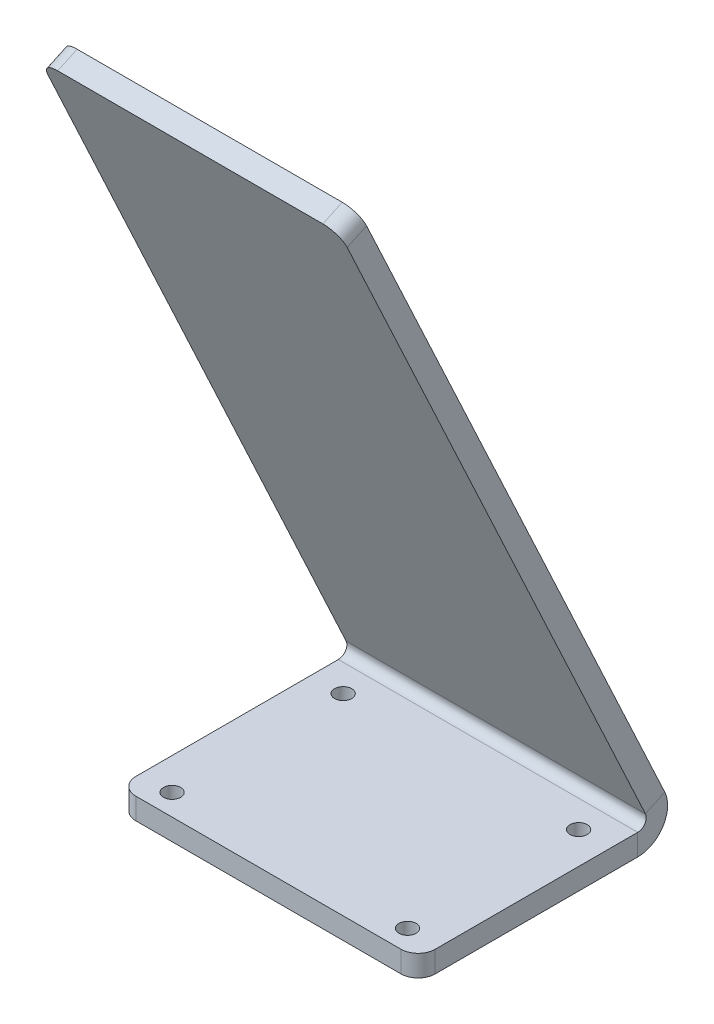
ISO-10303-21;
HEADER;
FILE_DESCRIPTION(('STEP AP214'),'2;1');
FILE_NAME('part.step','',(''),(''),'','','');
FILE_SCHEMA(('AUTOMOTIVE_DESIGN { 1 0 10303 214 1 1 1 1 }'));
ENDSEC;
DATA;
#1=APPLICATION_CONTEXT('core data for automotive mechanical design processes');
#2=APPLICATION_PROTOCOL_DEFINITION('international standard','automotive_design',2000,#1);
#3=PRODUCT_CONTEXT('',#1,'mechanical');
#4=PRODUCT('Part','Part','',(#3));
#5=PRODUCT_RELATED_PRODUCT_CATEGORY('part','',(#4));
#6=PRODUCT_DEFINITION_FORMATION('','',#4);
#7=PRODUCT_DEFINITION_CONTEXT('part definition',#1,'design');
#8=PRODUCT_DEFINITION('design','',#6,#7);
#9=PRODUCT_DEFINITION_SHAPE('','',#8);
#10=(LENGTH_UNIT() NAMED_UNIT(*) SI_UNIT(.MILLI.,.METRE.));
#11=(NAMED_UNIT(*) PLANE_ANGLE_UNIT() SI_UNIT($,.RADIAN.));
#12=(NAMED_UNIT(*) SI_UNIT($,.STERADIAN.) SOLID_ANGLE_UNIT());
#13=UNCERTAINTY_MEASURE_WITH_UNIT(LENGTH_MEASURE(1.E-05),#10,'distance_accuracy_value','');
#14=(GEOMETRIC_REPRESENTATION_CONTEXT(3) GLOBAL_UNCERTAINTY_ASSIGNED_CONTEXT((#13)) GLOBAL_UNIT_ASSIGNED_CONTEXT((#10,
#11,#12)) REPRESENTATION_CONTEXT('',''));
#15=CARTESIAN_POINT('',(0.,0.,0.));
#16=DIRECTION('',(0.,0.,1.));
#17=DIRECTION('',(1.,0.,0.));
#18=AXIS2_PLACEMENT_3D('',#15,#16,#17);
#19=CARTESIAN_POINT('',(0.,0.,0.));
#20=DIRECTION('',(0.,-1.,0.));
#21=DIRECTION('',(0.,0.,-1.));
#22=AXIS2_PLACEMENT_3D('',#19,#20,#21);
#23=PLANE('',#22);
#24=CARTESIAN_POINT('',(-34.9631,0.,-19.05));
#25=DIRECTION('',(0.,1.,0.));
#26=DIRECTION('',(0.,0.,1.));
#27=AXIS2_PLACEMENT_3D('',#24,#25,#26);
#28=CIRCLE('',#27,2.5527);
#29=CARTESIAN_POINT('',(-34.9631,0.,-16.4973));
#30=VERTEX_POINT('',#29);
#31=EDGE_CURVE('E549',#30,#30,#28,.T.);
#32=ORIENTED_EDGE('',*,*,#31,.F.);
#33=EDGE_LOOP('',(#32));
#34=FACE_BOUND('',#33,.T.);
#35=CARTESIAN_POINT('',(34.9631,0.,-19.05));
#36=DIRECTION('',(0.,1.,0.));
#37=DIRECTION('',(0.,0.,1.));
#38=AXIS2_PLACEMENT_3D('',#35,#36,#37);
#39=CIRCLE('',#38,2.5527);
#40=CARTESIAN_POINT('',(34.9631,0.,-16.4973));
#41=VERTEX_POINT('',#40);
#42=EDGE_CURVE('E543',#41,#41,#39,.T.);
#43=ORIENTED_EDGE('',*,*,#42,.F.);
#44=EDGE_LOOP('',(#43));
#45=FACE_BOUND('',#44,.T.);
#46=CARTESIAN_POINT('',(-34.9631,0.,31.75));
#47=DIRECTION('',(0.,1.,0.));
#48=DIRECTION('',(0.,0.,1.));
#49=AXIS2_PLACEMENT_3D('',#46,#47,#48);
#50=CIRCLE('',#49,2.5527);
#51=CARTESIAN_POINT('',(-34.9631,0.,34.3027));
#52=VERTEX_POINT('',#51);
#53=EDGE_CURVE('E530',#52,#52,#50,.T.);
#54=ORIENTED_EDGE('',*,*,#53,.F.);
#55=EDGE_LOOP('',(#54));
#56=FACE_BOUND('',#55,.T.);
#57=DIRECTION('',(1.,0.,0.));
#58=VECTOR('',#57,1.);
#59=CARTESIAN_POINT('',(-44.45,0.,38.1));
#60=LINE('',#59,#58);
#61=CARTESIAN_POINT('',(-39.37,0.,38.1));
#62=VERTEX_POINT('',#61);
#63=CARTESIAN_POINT('',(39.37,0.,38.1));
#64=VERTEX_POINT('',#63);
#65=EDGE_CURVE('E225',#62,#64,#60,.T.);
#66=ORIENTED_EDGE('',*,*,#65,.T.);
#67=CARTESIAN_POINT('',(39.37,0.,33.02));
#68=DIRECTION('',(0.,-1.,0.));
#69=DIRECTION('',(0.,0.,-1.));
#70=AXIS2_PLACEMENT_3D('',#67,#68,#69);
#71=CIRCLE('',#70,5.08);
#72=CARTESIAN_POINT('',(44.45,0.,33.02));
#73=VERTEX_POINT('',#72);
#74=EDGE_CURVE('E244',#64,#73,#71,.F.);
#75=ORIENTED_EDGE('',*,*,#74,.T.);
#76=DIRECTION('',(0.,0.,-1.));
#77=VECTOR('',#76,1.);
#78=CARTESIAN_POINT('',(44.45,0.,38.1));
#79=LINE('',#78,#77);
#80=CARTESIAN_POINT('',(44.45,0.,-27.1065488487098));
#81=VERTEX_POINT('',#80);
#82=EDGE_CURVE('E220',#73,#81,#79,.T.);
#83=ORIENTED_EDGE('',*,*,#82,.T.);
#84=DIRECTION('',(-1.,0.,0.));
#85=VECTOR('',#84,1.);
#86=CARTESIAN_POINT('',(-44.45,0.,-27.1065488487098));
#87=LINE('',#86,#85);
#88=CARTESIAN_POINT('',(-44.45,0.,-27.1065488487098));
#89=VERTEX_POINT('',#88);
#90=EDGE_CURVE('E213',#89,#81,#87,.F.);
#91=ORIENTED_EDGE('',*,*,#90,.F.);
#92=DIRECTION('',(0.,0.,1.));
#93=VECTOR('',#92,1.);
#94=CARTESIAN_POINT('',(-44.45,0.,38.1));
#95=LINE('',#94,#93);
#96=CARTESIAN_POINT('',(-44.45,0.,33.02));
#97=VERTEX_POINT('',#96);
#98=EDGE_CURVE('E233',#89,#97,#95,.T.);
#99=ORIENTED_EDGE('',*,*,#98,.T.);
#100=CARTESIAN_POINT('',(-39.37,0.,33.02));
#101=DIRECTION('',(0.,-1.,0.));
#102=DIRECTION('',(0.,0.,-1.));
#103=AXIS2_PLACEMENT_3D('',#100,#101,#102);
#104=CIRCLE('',#103,5.08);
#105=EDGE_CURVE('E242',#97,#62,#104,.F.);
#106=ORIENTED_EDGE('',*,*,#105,.T.);
#107=EDGE_LOOP('',(#66,#75,#83,#91,#99,#106));
#108=FACE_BOUND('',#107,.T.);
#109=CARTESIAN_POINT('',(34.9631,0.,31.75));
#110=DIRECTION('',(0.,1.,0.));
#111=DIRECTION('',(0.,0.,1.));
#112=AXIS2_PLACEMENT_3D('',#109,#110,#111);
#113=CIRCLE('',#112,2.5527);
#114=CARTESIAN_POINT('',(34.9631,0.,34.3027));
#115=VERTEX_POINT('',#114);
#116=EDGE_CURVE('E535',#115,#115,#113,.T.);
#117=ORIENTED_EDGE('',*,*,#116,.F.);
#118=EDGE_LOOP('',(#117));
#119=FACE_BOUND('',#118,.T.);
#120=ADVANCED_FACE('F69',(#34,#45,#56,#108,#119),#23,.F.);
#121=CARTESIAN_POINT('',(-44.45,-6.35,38.1));
#122=DIRECTION('',(-1.,0.,0.));
#123=DIRECTION('',(0.,0.,1.));
#124=AXIS2_PLACEMENT_3D('',#121,#122,#123);
#125=PLANE('',#124);
#126=DIRECTION('',(0.,0.,1.));
#127=VECTOR('',#126,1.);
#128=CARTESIAN_POINT('',(-44.45,-6.35,38.1));
#129=LINE('',#128,#127);
#130=CARTESIAN_POINT('',(-44.45,-6.34999999999998,-27.1065488487098));
#131=VERTEX_POINT('',#130);
#132=CARTESIAN_POINT('',(-44.45,-6.35,33.02));
#133=VERTEX_POINT('',#132);
#134=EDGE_CURVE('E224',#131,#133,#129,.T.);
#135=ORIENTED_EDGE('',*,*,#134,.T.);
#136=DIRECTION('',(0.,1.,0.));
#137=VECTOR('',#136,1.);
#138=CARTESIAN_POINT('',(-44.45,-6.35,33.02));
#139=LINE('',#138,#137);
#140=EDGE_CURVE('E252',#133,#97,#139,.T.);
#141=ORIENTED_EDGE('',*,*,#140,.T.);
#142=ORIENTED_EDGE('',*,*,#98,.F.);
#143=DIRECTION('',(0.,-1.,0.));
#144=VECTOR('',#143,1.);
#145=CARTESIAN_POINT('',(-44.45,0.,-27.1065488487098));
#146=LINE('',#145,#144);
#147=EDGE_CURVE('E209',#89,#131,#146,.T.);
#148=ORIENTED_EDGE('',*,*,#147,.T.);
#149=EDGE_LOOP('',(#135,#141,#142,#148));
#150=FACE_BOUND('',#149,.T.);
#151=ADVANCED_FACE('F314',(#150),#125,.T.);
#152=CARTESIAN_POINT('',(0.,-6.35,0.));
#153=DIRECTION('',(0.,-1.,0.));
#154=DIRECTION('',(0.,0.,-1.));
#155=AXIS2_PLACEMENT_3D('',#152,#153,#154);
#156=PLANE('',#155);
#157=CARTESIAN_POINT('',(-34.9631,-6.35,-19.05));
#158=DIRECTION('',(0.,1.,0.));
#159=DIRECTION('',(0.,0.,1.));
#160=AXIS2_PLACEMENT_3D('',#157,#158,#159);
#161=CIRCLE('',#160,2.5527);
#162=CARTESIAN_POINT('',(-34.9631,-6.35,-16.4973));
#163=VERTEX_POINT('',#162);
#164=EDGE_CURVE('E546',#163,#163,#161,.T.);
#165=ORIENTED_EDGE('',*,*,#164,.T.);
#166=EDGE_LOOP('',(#165));
#167=FACE_BOUND('',#166,.T.);
#168=CARTESIAN_POINT('',(34.9631,-6.35,-19.05));
#169=DIRECTION('',(0.,1.,0.));
#170=DIRECTION('',(0.,0.,1.));
#171=AXIS2_PLACEMENT_3D('',#168,#169,#170);
#172=CIRCLE('',#171,2.5527);
#173=CARTESIAN_POINT('',(34.9631,-6.35,-16.4973));
#174=VERTEX_POINT('',#173);
#175=EDGE_CURVE('E540',#174,#174,#172,.T.);
#176=ORIENTED_EDGE('',*,*,#175,.T.);
#177=EDGE_LOOP('',(#176));
#178=FACE_BOUND('',#177,.T.);
#179=CARTESIAN_POINT('',(34.9631,-6.35,31.75));
#180=DIRECTION('',(0.,1.,0.));
#181=DIRECTION('',(0.,0.,1.));
#182=AXIS2_PLACEMENT_3D('',#179,#180,#181);
#183=CIRCLE('',#182,2.5527);
#184=CARTESIAN_POINT('',(34.9631,-6.35,34.3027));
#185=VERTEX_POINT('',#184);
#186=EDGE_CURVE('E532',#185,#185,#183,.T.);
#187=ORIENTED_EDGE('',*,*,#186,.T.);
#188=EDGE_LOOP('',(#187));
#189=FACE_BOUND('',#188,.T.);
#190=CARTESIAN_POINT('',(-34.9631,-6.35,31.75));
#191=DIRECTION('',(0.,1.,0.));
#192=DIRECTION('',(0.,0.,1.));
#193=AXIS2_PLACEMENT_3D('',#190,#191,#192);
#194=CIRCLE('',#193,2.5527);
#195=CARTESIAN_POINT('',(-34.9631,-6.35,34.3027));
#196=VERTEX_POINT('',#195);
#197=EDGE_CURVE('E206',#196,#196,#194,.T.);
#198=ORIENTED_EDGE('',*,*,#197,.T.);
#199=EDGE_LOOP('',(#198));
#200=FACE_BOUND('',#199,.T.);
#201=DIRECTION('',(0.,0.,-1.));
#202=VECTOR('',#201,1.);
#203=CARTESIAN_POINT('',(44.45,-6.35,38.1));
#204=LINE('',#203,#202);
#205=CARTESIAN_POINT('',(44.45,-6.35,33.02));
#206=VERTEX_POINT('',#205);
#207=CARTESIAN_POINT('',(44.45,-6.35,-27.1065488487098));
#208=VERTEX_POINT('',#207);
#209=EDGE_CURVE('E222',#206,#208,#204,.T.);
#210=ORIENTED_EDGE('',*,*,#209,.F.);
#211=CARTESIAN_POINT('',(39.37,-6.35,33.02));
#212=DIRECTION('',(0.,-1.,0.));
#213=DIRECTION('',(0.,0.,-1.));
#214=AXIS2_PLACEMENT_3D('',#211,#212,#213);
#215=CIRCLE('',#214,5.08);
#216=CARTESIAN_POINT('',(39.37,-6.35,38.1));
#217=VERTEX_POINT('',#216);
#218=EDGE_CURVE('E250',#206,#217,#215,.T.);
#219=ORIENTED_EDGE('',*,*,#218,.T.);
#220=DIRECTION('',(1.,0.,0.));
#221=VECTOR('',#220,1.);
#222=CARTESIAN_POINT('',(-44.45,-6.35,38.1));
#223=LINE('',#222,#221);
#224=CARTESIAN_POINT('',(-39.37,-6.35,38.1));
#225=VERTEX_POINT('',#224);
#226=EDGE_CURVE('E228',#225,#217,#223,.T.);
#227=ORIENTED_EDGE('',*,*,#226,.F.);
#228=CARTESIAN_POINT('',(-39.37,-6.35,33.02));
#229=DIRECTION('',(0.,-1.,0.));
#230=DIRECTION('',(0.,0.,-1.));
#231=AXIS2_PLACEMENT_3D('',#228,#229,#230);
#232=CIRCLE('',#231,5.08);
#233=EDGE_CURVE('E248',#225,#133,#232,.T.);
#234=ORIENTED_EDGE('',*,*,#233,.T.);
#235=ORIENTED_EDGE('',*,*,#134,.F.);
#236=DIRECTION('',(-1.,0.,0.));
#237=VECTOR('',#236,1.);
#238=CARTESIAN_POINT('',(-44.45,-6.34999999999998,-27.1065488487098));
#239=LINE('',#238,#237);
#240=EDGE_CURVE('E169',#131,#208,#239,.F.);
#241=ORIENTED_EDGE('',*,*,#240,.T.);
#242=EDGE_LOOP('',(#210,#219,#227,#234,#235,#241));
#243=FACE_BOUND('',#242,.T.);
#244=ADVANCED_FACE('F296',(#167,#178,#189,#200,#243),#156,.T.);
#245=CARTESIAN_POINT('',(44.45,-6.35,38.1));
#246=DIRECTION('',(1.,0.,0.));
#247=DIRECTION('',(0.,0.,-1.));
#248=AXIS2_PLACEMENT_3D('',#245,#246,#247);
#249=PLANE('',#248);
#250=ORIENTED_EDGE('',*,*,#82,.F.);
#251=DIRECTION('',(0.,1.,0.));
#252=VECTOR('',#251,1.);
#253=CARTESIAN_POINT('',(44.45,-6.35,33.02));
#254=LINE('',#253,#252);
#255=EDGE_CURVE('E246',#73,#206,#254,.F.);
#256=ORIENTED_EDGE('',*,*,#255,.T.);
#257=ORIENTED_EDGE('',*,*,#209,.T.);
#258=DIRECTION('',(0.,-1.,0.));
#259=VECTOR('',#258,1.);
#260=CARTESIAN_POINT('',(44.45,0.,-27.1065488487098));
#261=LINE('',#260,#259);
#262=EDGE_CURVE('E217',#81,#208,#261,.T.);
#263=ORIENTED_EDGE('',*,*,#262,.F.);
#264=EDGE_LOOP('',(#250,#256,#257,#263));
#265=FACE_BOUND('',#264,.T.);
#266=ADVANCED_FACE('F291',(#265),#249,.T.);
#267=CARTESIAN_POINT('',(-44.45,-6.35,38.1));
#268=DIRECTION('',(0.,0.,1.));
#269=DIRECTION('',(1.,0.,0.));
#270=AXIS2_PLACEMENT_3D('',#267,#268,#269);
#271=PLANE('',#270);
#272=ORIENTED_EDGE('',*,*,#226,.T.);
#273=DIRECTION('',(0.,1.,0.));
#274=VECTOR('',#273,1.);
#275=CARTESIAN_POINT('',(39.37,-6.35,38.1));
#276=LINE('',#275,#274);
#277=EDGE_CURVE('E239',#217,#64,#276,.T.);
#278=ORIENTED_EDGE('',*,*,#277,.T.);
#279=ORIENTED_EDGE('',*,*,#65,.F.);
#280=DIRECTION('',(0.,1.,0.));
#281=VECTOR('',#280,1.);
#282=CARTESIAN_POINT('',(-39.37,-6.35,38.1));
#283=LINE('',#282,#281);
#284=EDGE_CURVE('E231',#62,#225,#283,.F.);
#285=ORIENTED_EDGE('',*,*,#284,.T.);
#286=EDGE_LOOP('',(#272,#278,#279,#285));
#287=FACE_BOUND('',#286,.T.);
#288=ADVANCED_FACE('F304',(#287),#271,.T.);
#289=CARTESIAN_POINT('',(44.45,2.54000000000001,-27.1065488487098));
#290=DIRECTION('',(1.,0.,0.));
#291=DIRECTION('',(0.,1.,0.));
#292=AXIS2_PLACEMENT_3D('',#289,#290,#291);
#293=PLANE('',#292);
#294=DIRECTION('',(0.,-0.422618261740697,0.906307787036651));
#295=VECTOR('',#294,1.);
#296=CARTESIAN_POINT('',(44.45,6.2970763468748,-35.1636250754656));
#297=LINE('',#296,#295);
#298=CARTESIAN_POINT('',(44.45,3.61345038482138,-29.4085706277829));
#299=VERTEX_POINT('',#298);
#300=CARTESIAN_POINT('',(44.45,6.2970763468748,-35.1636250754656));
#301=VERTEX_POINT('',#300);
#302=EDGE_CURVE('E203',#299,#301,#297,.F.);
#303=ORIENTED_EDGE('',*,*,#302,.F.);
#304=CARTESIAN_POINT('',(44.45,2.54000000000001,-27.1065488487098));
#305=DIRECTION('',(-1.,0.,0.));
#306=DIRECTION('',(0.,-1.,0.));
#307=AXIS2_PLACEMENT_3D('',#304,#305,#306);
#308=CIRCLE('',#307,2.53999999999999);
#309=EDGE_CURVE('E172',#81,#299,#308,.F.);
#310=ORIENTED_EDGE('',*,*,#309,.F.);
#311=ORIENTED_EDGE('',*,*,#262,.T.);
#312=CARTESIAN_POINT('',(44.45,2.54000000000001,-27.1065488487098));
#313=DIRECTION('',(-1.,0.,0.));
#314=DIRECTION('',(0.,-1.,0.));
#315=AXIS2_PLACEMENT_3D('',#312,#313,#314);
#316=CIRCLE('',#315,8.88999999999999);
#317=EDGE_CURVE('E208',#208,#301,#316,.F.);
#318=ORIENTED_EDGE('',*,*,#317,.T.);
#319=EDGE_LOOP('',(#303,#310,#311,#318));
#320=FACE_BOUND('',#319,.T.);
#321=ADVANCED_FACE('F288',(#320),#293,.T.);
#322=CARTESIAN_POINT('',(-44.45,2.54000000000002,-27.1065488487098));
#323=DIRECTION('',(1.,0.,0.));
#324=DIRECTION('',(0.,1.,0.));
#325=AXIS2_PLACEMENT_3D('',#322,#323,#324);
#326=PLANE('',#325);
#327=CARTESIAN_POINT('',(-44.45,2.54000000000002,-27.1065488487098));
#328=DIRECTION('',(-1.,0.,0.));
#329=DIRECTION('',(0.,-1.,0.));
#330=AXIS2_PLACEMENT_3D('',#327,#328,#329);
#331=CIRCLE('',#330,2.53999999999999);
#332=CARTESIAN_POINT('',(-44.45,3.61345038482138,-29.4085706277829));
#333=VERTEX_POINT('',#332);
#334=EDGE_CURVE('E179',#333,#89,#331,.T.);
#335=ORIENTED_EDGE('',*,*,#334,.F.);
#336=DIRECTION('',(0.,-0.422618261740697,0.906307787036651));
#337=VECTOR('',#336,1.);
#338=CARTESIAN_POINT('',(-44.45,3.61345038482138,-29.4085706277829));
#339=LINE('',#338,#337);
#340=CARTESIAN_POINT('',(-44.45,6.29707634687481,-35.1636250754656));
#341=VERTEX_POINT('',#340);
#342=EDGE_CURVE('E176',#333,#341,#339,.F.);
#343=ORIENTED_EDGE('',*,*,#342,.T.);
#344=CARTESIAN_POINT('',(-44.45,2.54000000000002,-27.1065488487098));
#345=DIRECTION('',(-1.,0.,0.));
#346=DIRECTION('',(0.,-1.,0.));
#347=AXIS2_PLACEMENT_3D('',#344,#345,#346);
#348=CIRCLE('',#347,8.88999999999999);
#349=EDGE_CURVE('E161',#341,#131,#348,.T.);
#350=ORIENTED_EDGE('',*,*,#349,.T.);
#351=ORIENTED_EDGE('',*,*,#147,.F.);
#352=EDGE_LOOP('',(#335,#343,#350,#351));
#353=FACE_BOUND('',#352,.T.);
#354=ADVANCED_FACE('F177',(#353),#326,.F.);
#355=CARTESIAN_POINT('',(-44.45,2.54000000000002,-27.1065488487098));
#356=DIRECTION('',(-1.,0.,0.));
#357=DIRECTION('',(0.,0.422618261740697,-0.906307787036651));
#358=AXIS2_PLACEMENT_3D('',#355,#356,#357);
#359=CYLINDRICAL_SURFACE('',#358,8.88999999999999);
#360=ORIENTED_EDGE('',*,*,#240,.F.);
#361=ORIENTED_EDGE('',*,*,#349,.F.);
#362=DIRECTION('',(-1.,0.,0.));
#363=VECTOR('',#362,1.);
#364=CARTESIAN_POINT('',(44.45,6.2970763468748,-35.1636250754656));
#365=LINE('',#364,#363);
#366=EDGE_CURVE('E166',#341,#301,#365,.F.);
#367=ORIENTED_EDGE('',*,*,#366,.T.);
#368=ORIENTED_EDGE('',*,*,#317,.F.);
#369=EDGE_LOOP('',(#360,#361,#367,#368));
#370=FACE_BOUND('',#369,.T.);
#371=ADVANCED_FACE('F163',(#370),#359,.T.);
#372=CARTESIAN_POINT('',(-44.45,2.54000000000002,-27.1065488487098));
#373=DIRECTION('',(-1.,0.,0.));
#374=DIRECTION('',(0.,0.422618261740697,-0.906307787036651));
#375=AXIS2_PLACEMENT_3D('',#372,#373,#374);
#376=CYLINDRICAL_SURFACE('',#375,2.53999999999999);
#377=ORIENTED_EDGE('',*,*,#90,.T.);
#378=ORIENTED_EDGE('',*,*,#309,.T.);
#379=DIRECTION('',(-1.,0.,0.));
#380=VECTOR('',#379,1.);
#381=CARTESIAN_POINT('',(44.45,3.61345038482138,-29.4085706277829));
#382=LINE('',#381,#380);
#383=EDGE_CURVE('E181',#299,#333,#382,.T.);
#384=ORIENTED_EDGE('',*,*,#383,.T.);
#385=ORIENTED_EDGE('',*,*,#334,.T.);
#386=EDGE_LOOP('',(#377,#378,#384,#385));
#387=FACE_BOUND('',#386,.T.);
#388=ADVANCED_FACE('F283',(#387),#376,.F.);
#389=CARTESIAN_POINT('',(44.45,2.68362596205343,-36.8486046622709));
#390=DIRECTION('',(-1.,0.,0.));
#391=DIRECTION('',(0.,-1.,0.));
#392=AXIS2_PLACEMENT_3D('',#389,#390,#391);
#393=PLANE('',#392);
#394=DIRECTION('',(0.,-0.906307787036651,-0.422618261740697));
#395=VECTOR('',#394,1.);
#396=CARTESIAN_POINT('',(44.45,17.2767726034699,-30.0437086267996));
#397=LINE('',#396,#395);
#398=CARTESIAN_POINT('',(44.45,196.227916558432,53.4025802349963));
#399=VERTEX_POINT('',#398);
#400=EDGE_CURVE('E186',#399,#301,#397,.T.);
#401=ORIENTED_EDGE('',*,*,#400,.F.);
#402=DIRECTION('',(0.,-0.422618261740697,0.906307787036651));
#403=VECTOR('',#402,1.);
#404=CARTESIAN_POINT('',(44.45,196.227916558432,53.4025802349963));
#405=LINE('',#404,#403);
#406=CARTESIAN_POINT('',(44.45,193.544290596379,59.1576346826791));
#407=VERTEX_POINT('',#406);
#408=EDGE_CURVE('E15',#399,#407,#405,.T.);
#409=ORIENTED_EDGE('',*,*,#408,.T.);
#410=DIRECTION('',(0.,0.906307787036651,0.422618261740697));
#411=VECTOR('',#410,1.);
#412=CARTESIAN_POINT('',(44.45,0.,-31.0935502145882));
#413=LINE('',#412,#411);
#414=EDGE_CURVE('E187',#407,#299,#413,.F.);
#415=ORIENTED_EDGE('',*,*,#414,.T.);
#416=ORIENTED_EDGE('',*,*,#302,.T.);
#417=EDGE_LOOP('',(#401,#409,#415,#416));
#418=FACE_BOUND('',#417,.T.);
#419=ADVANCED_FACE('F280',(#418),#393,.F.);
#420=CARTESIAN_POINT('',(-44.45,200.831960116578,55.5494810046391));
#421=DIRECTION('',(1.,0.,0.));
#422=DIRECTION('',(0.,1.,0.));
#423=AXIS2_PLACEMENT_3D('',#420,#421,#422);
#424=PLANE('',#423);
#425=DIRECTION('',(0.,-0.906307787036651,-0.422618261740697));
#426=VECTOR('',#425,1.);
#427=CARTESIAN_POINT('',(-44.45,198.148334154525,61.3045354523218));
#428=LINE('',#427,#426);
#429=CARTESIAN_POINT('',(-44.45,193.544290596379,59.1576346826791));
#430=VERTEX_POINT('',#429);
#431=EDGE_CURVE('E199',#333,#430,#428,.F.);
#432=ORIENTED_EDGE('',*,*,#431,.T.);
#433=DIRECTION('',(0.,-0.422618261740697,0.906307787036651));
#434=VECTOR('',#433,1.);
#435=CARTESIAN_POINT('',(-44.45,196.227916558432,53.4025802349964));
#436=LINE('',#435,#434);
#437=CARTESIAN_POINT('',(-44.45,196.227916558432,53.4025802349964));
#438=VERTEX_POINT('',#437);
#439=EDGE_CURVE('E92',#430,#438,#436,.F.);
#440=ORIENTED_EDGE('',*,*,#439,.T.);
#441=DIRECTION('',(0.,0.906307787036651,0.422618261740697));
#442=VECTOR('',#441,1.);
#443=CARTESIAN_POINT('',(-44.45,17.2767726034699,-30.0437086267996));
#444=LINE('',#443,#442);
#445=EDGE_CURVE('E184',#341,#438,#444,.T.);
#446=ORIENTED_EDGE('',*,*,#445,.F.);
#447=ORIENTED_EDGE('',*,*,#342,.F.);
#448=EDGE_LOOP('',(#432,#440,#446,#447));
#449=FACE_BOUND('',#448,.T.);
#450=ADVANCED_FACE('F189',(#449),#424,.F.);
#451=CARTESIAN_POINT('',(0.,17.2767726034699,-30.0437086267996));
#452=DIRECTION('',(0.,-0.422618261740697,0.906307787036651));
#453=DIRECTION('',(0.,-0.906307787036651,-0.422618261740697));
#454=AXIS2_PLACEMENT_3D('',#451,#452,#453);
#455=PLANE('',#454);
#456=ORIENTED_EDGE('',*,*,#445,.T.);
#457=CARTESIAN_POINT('',(-39.37,196.227916558432,53.4025802349963));
#458=DIRECTION('',(0.,-0.422618261740697,0.906307787036651));
#459=DIRECTION('',(0.,-0.906307787036651,-0.422618261740697));
#460=AXIS2_PLACEMENT_3D('',#457,#458,#459);
#461=CIRCLE('',#460,5.08);
#462=CARTESIAN_POINT('',(-39.37,200.831960116578,55.5494810046391));
#463=VERTEX_POINT('',#462);
#464=EDGE_CURVE('E77',#438,#463,#461,.F.);
#465=ORIENTED_EDGE('',*,*,#464,.T.);
#466=DIRECTION('',(1.,0.,0.));
#467=VECTOR('',#466,1.);
#468=CARTESIAN_POINT('',(0.,200.831960116578,55.5494810046391));
#469=LINE('',#468,#467);
#470=CARTESIAN_POINT('',(39.37,200.831960116578,55.5494810046391));
#471=VERTEX_POINT('',#470);
#472=EDGE_CURVE('E190',#463,#471,#469,.T.);
#473=ORIENTED_EDGE('',*,*,#472,.T.);
#474=CARTESIAN_POINT('',(39.37,196.227916558432,53.4025802349963));
#475=DIRECTION('',(0.,-0.422618261740697,0.906307787036651));
#476=DIRECTION('',(0.,-0.906307787036651,-0.422618261740697));
#477=AXIS2_PLACEMENT_3D('',#474,#475,#476);
#478=CIRCLE('',#477,5.08);
#479=EDGE_CURVE('E84',#471,#399,#478,.F.);
#480=ORIENTED_EDGE('',*,*,#479,.T.);
#481=ORIENTED_EDGE('',*,*,#400,.T.);
#482=ORIENTED_EDGE('',*,*,#366,.F.);
#483=EDGE_LOOP('',(#456,#465,#473,#480,#481,#482));
#484=FACE_BOUND('',#483,.T.);
#485=ADVANCED_FACE('F183',(#484),#455,.F.);
#486=CARTESIAN_POINT('',(0.,14.5931466414165,-24.2886541791169));
#487=DIRECTION('',(0.,-0.422618261740697,0.906307787036651));
#488=DIRECTION('',(0.,-0.906307787036651,-0.422618261740697));
#489=AXIS2_PLACEMENT_3D('',#486,#487,#488);
#490=PLANE('',#489);
#491=DIRECTION('',(-1.,0.,0.));
#492=VECTOR('',#491,1.);
#493=CARTESIAN_POINT('',(44.45,198.148334154525,61.3045354523218));
#494=LINE('',#493,#492);
#495=CARTESIAN_POINT('',(-39.37,198.148334154525,61.3045354523218));
#496=VERTEX_POINT('',#495);
#497=CARTESIAN_POINT('',(39.37,198.148334154525,61.3045354523218));
#498=VERTEX_POINT('',#497);
#499=EDGE_CURVE('E193',#496,#498,#494,.F.);
#500=ORIENTED_EDGE('',*,*,#499,.F.);
#501=CARTESIAN_POINT('',(-39.37,193.544290596379,59.1576346826791));
#502=DIRECTION('',(0.,-0.422618261740697,0.906307787036651));
#503=DIRECTION('',(0.,-0.906307787036651,-0.422618261740697));
#504=AXIS2_PLACEMENT_3D('',#501,#502,#503);
#505=CIRCLE('',#504,5.08);
#506=EDGE_CURVE('E262',#496,#430,#505,.T.);
#507=ORIENTED_EDGE('',*,*,#506,.T.);
#508=ORIENTED_EDGE('',*,*,#431,.F.);
#509=ORIENTED_EDGE('',*,*,#383,.F.);
#510=ORIENTED_EDGE('',*,*,#414,.F.);
#511=CARTESIAN_POINT('',(39.37,193.544290596379,59.1576346826791));
#512=DIRECTION('',(0.,-0.422618261740697,0.906307787036651));
#513=DIRECTION('',(0.,-0.906307787036651,-0.422618261740697));
#514=AXIS2_PLACEMENT_3D('',#511,#512,#513);
#515=CIRCLE('',#514,5.08);
#516=EDGE_CURVE('E260',#407,#498,#515,.T.);
#517=ORIENTED_EDGE('',*,*,#516,.T.);
#518=EDGE_LOOP('',(#500,#507,#508,#509,#510,#517));
#519=FACE_BOUND('',#518,.T.);
#520=ADVANCED_FACE('F274',(#519),#490,.T.);
#521=CARTESIAN_POINT('',(44.45,200.831960116578,55.5494810046391));
#522=DIRECTION('',(0.,-0.906307787036651,-0.422618261740697));
#523=DIRECTION('',(0.,0.422618261740697,-0.906307787036651));
#524=AXIS2_PLACEMENT_3D('',#521,#522,#523);
#525=PLANE('',#524);
#526=ORIENTED_EDGE('',*,*,#472,.F.);
#527=DIRECTION('',(0.,-0.422618261740697,0.906307787036651));
#528=VECTOR('',#527,1.);
#529=CARTESIAN_POINT('',(-39.37,200.831960116578,55.5494810046391));
#530=LINE('',#529,#528);
#531=EDGE_CURVE('E257',#463,#496,#530,.T.);
#532=ORIENTED_EDGE('',*,*,#531,.T.);
#533=ORIENTED_EDGE('',*,*,#499,.T.);
#534=DIRECTION('',(0.,-0.422618261740697,0.906307787036651));
#535=VECTOR('',#534,1.);
#536=CARTESIAN_POINT('',(39.37,200.831960116578,55.5494810046391));
#537=LINE('',#536,#535);
#538=EDGE_CURVE('E255',#498,#471,#537,.F.);
#539=ORIENTED_EDGE('',*,*,#538,.T.);
#540=EDGE_LOOP('',(#526,#532,#533,#539));
#541=FACE_BOUND('',#540,.T.);
#542=ADVANCED_FACE('F269',(#541),#525,.F.);
#543=CARTESIAN_POINT('',(-34.9631,0.,31.75));
#544=DIRECTION('',(0.,1.,0.));
#545=DIRECTION('',(0.,0.,1.));
#546=AXIS2_PLACEMENT_3D('',#543,#544,#545);
#547=CYLINDRICAL_SURFACE('',#546,2.5527);
#548=ORIENTED_EDGE('',*,*,#197,.F.);
#549=EDGE_LOOP('',(#548));
#550=FACE_BOUND('',#549,.T.);
#551=ORIENTED_EDGE('',*,*,#53,.T.);
#552=EDGE_LOOP('',(#551));
#553=FACE_BOUND('',#552,.T.);
#554=ADVANCED_FACE('F366',(#550,#553),#547,.F.);
#555=CARTESIAN_POINT('',(34.9631,0.,31.75));
#556=DIRECTION('',(0.,1.,0.));
#557=DIRECTION('',(0.,0.,1.));
#558=AXIS2_PLACEMENT_3D('',#555,#556,#557);
#559=CYLINDRICAL_SURFACE('',#558,2.5527);
#560=ORIENTED_EDGE('',*,*,#186,.F.);
#561=EDGE_LOOP('',(#560));
#562=FACE_BOUND('',#561,.T.);
#563=ORIENTED_EDGE('',*,*,#116,.T.);
#564=EDGE_LOOP('',(#563));
#565=FACE_BOUND('',#564,.T.);
#566=ADVANCED_FACE('F458',(#562,#565),#559,.F.);
#567=CARTESIAN_POINT('',(34.9631,0.,-19.05));
#568=DIRECTION('',(0.,1.,0.));
#569=DIRECTION('',(0.,0.,1.));
#570=AXIS2_PLACEMENT_3D('',#567,#568,#569);
#571=CYLINDRICAL_SURFACE('',#570,2.5527);
#572=ORIENTED_EDGE('',*,*,#175,.F.);
#573=EDGE_LOOP('',(#572));
#574=FACE_BOUND('',#573,.T.);
#575=ORIENTED_EDGE('',*,*,#42,.T.);
#576=EDGE_LOOP('',(#575));
#577=FACE_BOUND('',#576,.T.);
#578=ADVANCED_FACE('F448',(#574,#577),#571,.F.);
#579=CARTESIAN_POINT('',(-34.9631,0.,-19.05));
#580=DIRECTION('',(0.,1.,0.));
#581=DIRECTION('',(0.,0.,1.));
#582=AXIS2_PLACEMENT_3D('',#579,#580,#581);
#583=CYLINDRICAL_SURFACE('',#582,2.5527);
#584=ORIENTED_EDGE('',*,*,#164,.F.);
#585=EDGE_LOOP('',(#584));
#586=FACE_BOUND('',#585,.T.);
#587=ORIENTED_EDGE('',*,*,#31,.T.);
#588=EDGE_LOOP('',(#587));
#589=FACE_BOUND('',#588,.T.);
#590=ADVANCED_FACE('F331',(#586,#589),#583,.F.);
#591=CARTESIAN_POINT('',(39.37,-6.35,33.02));
#592=DIRECTION('',(0.,1.,0.));
#593=DIRECTION('',(0.,0.,1.));
#594=AXIS2_PLACEMENT_3D('',#591,#592,#593);
#595=CYLINDRICAL_SURFACE('',#594,5.08);
#596=ORIENTED_EDGE('',*,*,#218,.F.);
#597=ORIENTED_EDGE('',*,*,#255,.F.);
#598=ORIENTED_EDGE('',*,*,#74,.F.);
#599=ORIENTED_EDGE('',*,*,#277,.F.);
#600=EDGE_LOOP('',(#596,#597,#598,#599));
#601=FACE_BOUND('',#600,.T.);
#602=ADVANCED_FACE('F301',(#601),#595,.T.);
#603=CARTESIAN_POINT('',(-39.37,-6.35,33.02));
#604=DIRECTION('',(0.,1.,0.));
#605=DIRECTION('',(0.,0.,1.));
#606=AXIS2_PLACEMENT_3D('',#603,#604,#605);
#607=CYLINDRICAL_SURFACE('',#606,5.08);
#608=ORIENTED_EDGE('',*,*,#233,.F.);
#609=ORIENTED_EDGE('',*,*,#284,.F.);
#610=ORIENTED_EDGE('',*,*,#105,.F.);
#611=ORIENTED_EDGE('',*,*,#140,.F.);
#612=EDGE_LOOP('',(#608,#609,#610,#611));
#613=FACE_BOUND('',#612,.T.);
#614=ADVANCED_FACE('F312',(#613),#607,.T.);
#615=CARTESIAN_POINT('',(-39.37,196.227916558432,53.4025802349964));
#616=DIRECTION('',(0.,-0.422618261740697,0.906307787036651));
#617=DIRECTION('',(0.,-0.906307787036651,-0.422618261740697));
#618=AXIS2_PLACEMENT_3D('',#615,#616,#617);
#619=CYLINDRICAL_SURFACE('',#618,5.08);
#620=ORIENTED_EDGE('',*,*,#464,.F.);
#621=ORIENTED_EDGE('',*,*,#439,.F.);
#622=ORIENTED_EDGE('',*,*,#506,.F.);
#623=ORIENTED_EDGE('',*,*,#531,.F.);
#624=EDGE_LOOP('',(#620,#621,#622,#623));
#625=FACE_BOUND('',#624,.T.);
#626=ADVANCED_FACE('F272',(#625),#619,.T.);
#627=CARTESIAN_POINT('',(39.37,196.227916558432,53.4025802349963));
#628=DIRECTION('',(0.,-0.422618261740697,0.906307787036651));
#629=DIRECTION('',(0.,-0.906307787036651,-0.422618261740697));
#630=AXIS2_PLACEMENT_3D('',#627,#628,#629);
#631=CYLINDRICAL_SURFACE('',#630,5.08);
#632=ORIENTED_EDGE('',*,*,#479,.F.);
#633=ORIENTED_EDGE('',*,*,#538,.F.);
#634=ORIENTED_EDGE('',*,*,#516,.F.);
#635=ORIENTED_EDGE('',*,*,#408,.F.);
#636=EDGE_LOOP('',(#632,#633,#634,#635));
#637=FACE_BOUND('',#636,.T.);
#638=ADVANCED_FACE('F71',(#637),#631,.T.);
#639=CLOSED_SHELL('',(#120,#151,#244,#266,#288,#321,#354,#371,#388,#419,#450,#485,#520,#542,
#554,#566,#578,#590,#602,#614,#626,#638));
#640=MANIFOLD_SOLID_BREP('B2',#639);
#641=ADVANCED_BREP_SHAPE_REPRESENTATION('',(#18,#640),#14);
#642=SHAPE_DEFINITION_REPRESENTATION(#9,#641);
ENDSEC;
END-ISO-10303-21;
